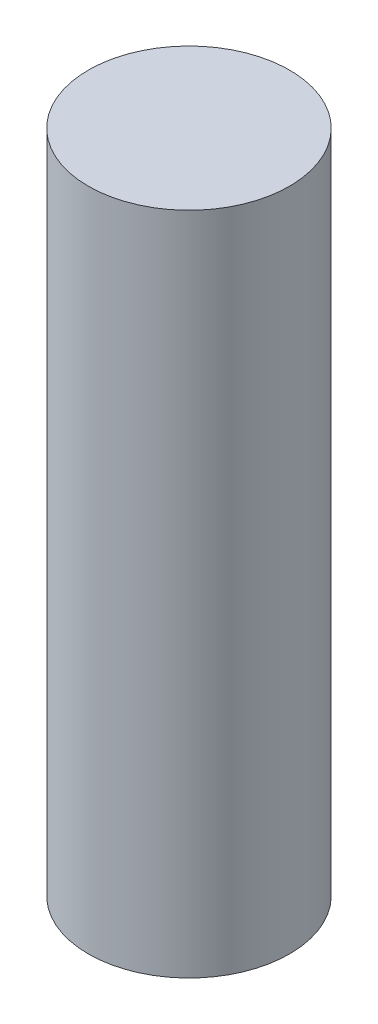
ISO-10303-21;
HEADER;
FILE_DESCRIPTION(('STEP AP214'),'2;1');
FILE_NAME('part.step','',(''),(''),'','','');
FILE_SCHEMA(('AUTOMOTIVE_DESIGN { 1 0 10303 214 1 1 1 1 }'));
ENDSEC;
DATA;
#1=APPLICATION_CONTEXT('core data for automotive mechanical design processes');
#2=APPLICATION_PROTOCOL_DEFINITION('international standard','automotive_design',2000,#1);
#3=PRODUCT_CONTEXT('',#1,'mechanical');
#4=PRODUCT('Part','Part','',(#3));
#5=PRODUCT_RELATED_PRODUCT_CATEGORY('part','',(#4));
#6=PRODUCT_DEFINITION_FORMATION('','',#4);
#7=PRODUCT_DEFINITION_CONTEXT('part definition',#1,'design');
#8=PRODUCT_DEFINITION('design','',#6,#7);
#9=PRODUCT_DEFINITION_SHAPE('','',#8);
#10=(LENGTH_UNIT() NAMED_UNIT(*) SI_UNIT(.MILLI.,.METRE.));
#11=(NAMED_UNIT(*) PLANE_ANGLE_UNIT() SI_UNIT($,.RADIAN.));
#12=(NAMED_UNIT(*) SI_UNIT($,.STERADIAN.) SOLID_ANGLE_UNIT());
#13=UNCERTAINTY_MEASURE_WITH_UNIT(LENGTH_MEASURE(1.E-05),#10,'distance_accuracy_value','');
#14=(GEOMETRIC_REPRESENTATION_CONTEXT(3) GLOBAL_UNCERTAINTY_ASSIGNED_CONTEXT((#13)) GLOBAL_UNIT_ASSIGNED_CONTEXT((#10,
#11,#12)) REPRESENTATION_CONTEXT('',''));
#15=CARTESIAN_POINT('',(0.,0.,0.));
#16=DIRECTION('',(0.,0.,1.));
#17=DIRECTION('',(1.,0.,0.));
#18=AXIS2_PLACEMENT_3D('',#15,#16,#17);
#19=CARTESIAN_POINT('',(0.,120.65,0.));
#20=DIRECTION('',(0.,-1.,0.));
#21=DIRECTION('',(0.,0.,-1.));
#22=AXIS2_PLACEMENT_3D('',#19,#20,#21);
#23=CYLINDRICAL_SURFACE('',#22,18.25625);
#24=CARTESIAN_POINT('',(0.,120.65,0.));
#25=DIRECTION('',(0.,1.,0.));
#26=DIRECTION('',(0.,0.,1.));
#27=AXIS2_PLACEMENT_3D('',#24,#25,#26);
#28=CIRCLE('',#27,18.25625);
#29=CARTESIAN_POINT('',(0.,120.65,18.25625));
#30=VERTEX_POINT('',#29);
#31=EDGE_CURVE('E10',#30,#30,#28,.T.);
#32=ORIENTED_EDGE('',*,*,#31,.F.);
#33=EDGE_LOOP('',(#32));
#34=FACE_BOUND('',#33,.T.);
#35=CARTESIAN_POINT('',(0.,0.,0.));
#36=DIRECTION('',(0.,1.,0.));
#37=DIRECTION('',(0.,0.,1.));
#38=AXIS2_PLACEMENT_3D('',#35,#36,#37);
#39=CIRCLE('',#38,18.25625);
#40=CARTESIAN_POINT('',(0.,0.,18.25625));
#41=VERTEX_POINT('',#40);
#42=EDGE_CURVE('E38',#41,#41,#39,.T.);
#43=ORIENTED_EDGE('',*,*,#42,.T.);
#44=EDGE_LOOP('',(#43));
#45=FACE_BOUND('',#44,.T.);
#46=ADVANCED_FACE('F35',(#34,#45),#23,.T.);
#47=CARTESIAN_POINT('',(0.,120.65,0.));
#48=DIRECTION('',(0.,1.,0.));
#49=DIRECTION('',(0.,0.,1.));
#50=AXIS2_PLACEMENT_3D('',#47,#48,#49);
#51=PLANE('',#50);
#52=ORIENTED_EDGE('',*,*,#31,.T.);
#53=EDGE_LOOP('',(#52));
#54=FACE_BOUND('',#53,.T.);
#55=ADVANCED_FACE('F50',(#54),#51,.T.);
#56=CARTESIAN_POINT('',(0.,0.,0.));
#57=DIRECTION('',(0.,1.,0.));
#58=DIRECTION('',(0.,0.,1.));
#59=AXIS2_PLACEMENT_3D('',#56,#57,#58);
#60=PLANE('',#59);
#61=ORIENTED_EDGE('',*,*,#42,.F.);
#62=EDGE_LOOP('',(#61));
#63=FACE_BOUND('',#62,.T.);
#64=ADVANCED_FACE('F48',(#63),#60,.F.);
#65=CLOSED_SHELL('',(#46,#55,#64));
#66=MANIFOLD_SOLID_BREP('B2',#65);
#67=ADVANCED_BREP_SHAPE_REPRESENTATION('',(#18,#66),#14);
#68=SHAPE_DEFINITION_REPRESENTATION(#9,#67);
ENDSEC;
END-ISO-10303-21;
